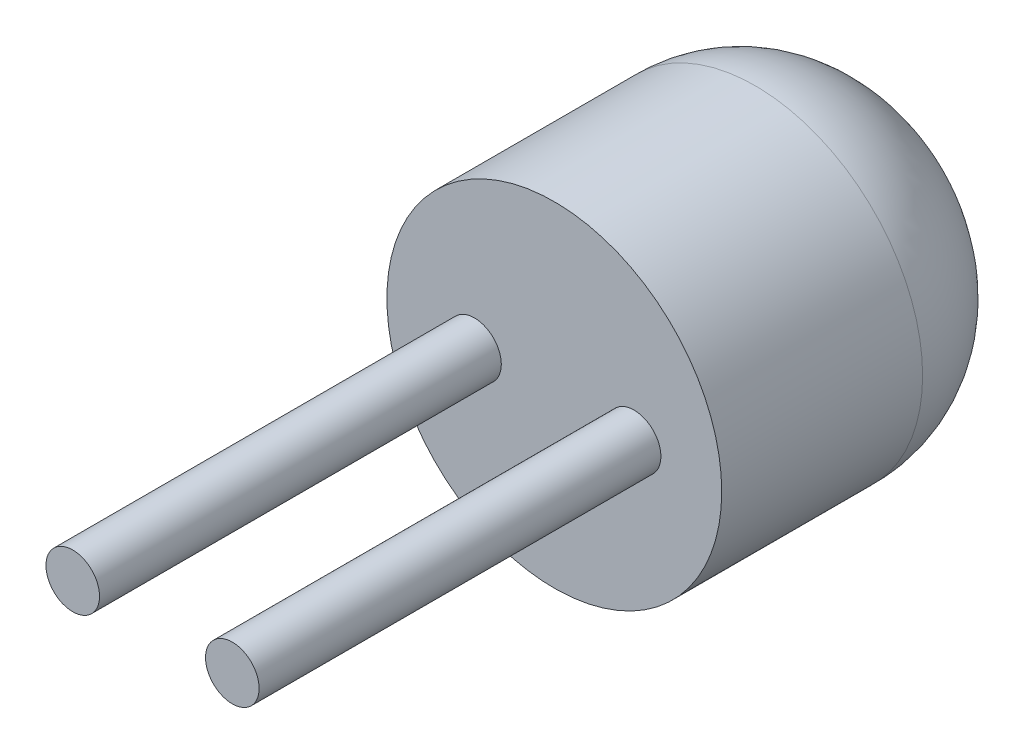
ISO-10303-21;
HEADER;
FILE_DESCRIPTION(('STEP AP214'),'2;1');
FILE_NAME('part.step','',(''),(''),'','','');
FILE_SCHEMA(('AUTOMOTIVE_DESIGN { 1 0 10303 214 1 1 1 1 }'));
ENDSEC;
DATA;
#1=APPLICATION_CONTEXT('core data for automotive mechanical design processes');
#2=APPLICATION_PROTOCOL_DEFINITION('international standard','automotive_design',2000,#1);
#3=PRODUCT_CONTEXT('',#1,'mechanical');
#4=PRODUCT('Part','Part','',(#3));
#5=PRODUCT_RELATED_PRODUCT_CATEGORY('part','',(#4));
#6=PRODUCT_DEFINITION_FORMATION('','',#4);
#7=PRODUCT_DEFINITION_CONTEXT('part definition',#1,'design');
#8=PRODUCT_DEFINITION('design','',#6,#7);
#9=PRODUCT_DEFINITION_SHAPE('','',#8);
#10=(LENGTH_UNIT() NAMED_UNIT(*) SI_UNIT(.MILLI.,.METRE.));
#11=(NAMED_UNIT(*) PLANE_ANGLE_UNIT() SI_UNIT($,.RADIAN.));
#12=(NAMED_UNIT(*) SI_UNIT($,.STERADIAN.) SOLID_ANGLE_UNIT());
#13=UNCERTAINTY_MEASURE_WITH_UNIT(LENGTH_MEASURE(1.E-05),#10,'distance_accuracy_value','');
#14=(GEOMETRIC_REPRESENTATION_CONTEXT(3) GLOBAL_UNCERTAINTY_ASSIGNED_CONTEXT((#13)) GLOBAL_UNIT_ASSIGNED_CONTEXT((#10,
#11,#12)) REPRESENTATION_CONTEXT('',''));
#15=CARTESIAN_POINT('',(0.,0.,0.));
#16=DIRECTION('',(0.,0.,1.));
#17=DIRECTION('',(1.,0.,0.));
#18=AXIS2_PLACEMENT_3D('',#15,#16,#17);
#19=CARTESIAN_POINT('',(-53.,46.9999999999999,-5.));
#20=DIRECTION('',(0.,0.,1.));
#21=DIRECTION('',(1.,0.,0.));
#22=AXIS2_PLACEMENT_3D('',#19,#20,#21);
#23=CYLINDRICAL_SURFACE('',#22,2.5);
#24=CARTESIAN_POINT('',(-53.,46.9999999999999,-3.));
#25=DIRECTION('',(0.,0.,1.));
#26=DIRECTION('',(1.,0.,0.));
#27=AXIS2_PLACEMENT_3D('',#24,#25,#26);
#28=CIRCLE('',#27,2.5);
#29=CARTESIAN_POINT('',(-50.5,46.9999999999999,-3.));
#30=VERTEX_POINT('',#29);
#31=EDGE_CURVE('E37',#30,#30,#28,.T.);
#32=ORIENTED_EDGE('',*,*,#31,.T.);
#33=EDGE_LOOP('',(#32));
#34=FACE_BOUND('',#33,.T.);
#35=CARTESIAN_POINT('',(-53.,46.9999999999999,0.));
#36=DIRECTION('',(0.,0.,1.));
#37=DIRECTION('',(1.,0.,0.));
#38=AXIS2_PLACEMENT_3D('',#35,#36,#37);
#39=CIRCLE('',#38,2.5);
#40=CARTESIAN_POINT('',(-50.5,46.9999999999999,0.));
#41=VERTEX_POINT('',#40);
#42=EDGE_CURVE('E41',#41,#41,#39,.T.);
#43=ORIENTED_EDGE('',*,*,#42,.F.);
#44=EDGE_LOOP('',(#43));
#45=FACE_BOUND('',#44,.T.);
#46=ADVANCED_FACE('F30',(#34,#45),#23,.T.);
#47=CARTESIAN_POINT('',(-53.,46.9999999999999,-5.));
#48=DIRECTION('',(0.,0.,1.));
#49=DIRECTION('',(1.,0.,0.));
#50=AXIS2_PLACEMENT_3D('',#47,#48,#49);
#51=PLANE('',#50);
#52=CARTESIAN_POINT('',(-53.,46.9999999999999,-5.));
#53=DIRECTION('',(0.,0.,1.));
#54=DIRECTION('',(1.,0.,0.));
#55=AXIS2_PLACEMENT_3D('',#52,#53,#54);
#56=CIRCLE('',#55,0.499999999999996);
#57=CARTESIAN_POINT('',(-52.5,46.9999999999999,-5.));
#58=VERTEX_POINT('',#57);
#59=EDGE_CURVE('E10',#58,#58,#56,.F.);
#60=ORIENTED_EDGE('',*,*,#59,.T.);
#61=EDGE_LOOP('',(#60));
#62=FACE_BOUND('',#61,.T.);
#63=ADVANCED_FACE('F73',(#62),#51,.F.);
#64=CARTESIAN_POINT('',(-53.,46.9999999999999,0.));
#65=DIRECTION('',(0.,0.,1.));
#66=DIRECTION('',(1.,0.,0.));
#67=AXIS2_PLACEMENT_3D('',#64,#65,#66);
#68=PLANE('',#67);
#69=CARTESIAN_POINT('',(-51.8084478668295,46.9999999999999,0.));
#70=DIRECTION('',(0.,0.,1.));
#71=DIRECTION('',(-1.,0.,0.));
#72=AXIS2_PLACEMENT_3D('',#69,#70,#71);
#73=CIRCLE('',#72,0.399999999999997);
#74=CARTESIAN_POINT('',(-52.2084478668295,46.9999999999999,0.));
#75=VERTEX_POINT('',#74);
#76=EDGE_CURVE('E54',#75,#75,#73,.T.);
#77=ORIENTED_EDGE('',*,*,#76,.F.);
#78=EDGE_LOOP('',(#77));
#79=FACE_BOUND('',#78,.T.);
#80=CARTESIAN_POINT('',(-54.1915521331706,46.9999999999999,0.));
#81=DIRECTION('',(0.,0.,1.));
#82=DIRECTION('',(1.,0.,0.));
#83=AXIS2_PLACEMENT_3D('',#80,#81,#82);
#84=CIRCLE('',#83,0.399999999999997);
#85=CARTESIAN_POINT('',(-53.7915521331706,46.9999999999999,0.));
#86=VERTEX_POINT('',#85);
#87=EDGE_CURVE('E48',#86,#86,#84,.T.);
#88=ORIENTED_EDGE('',*,*,#87,.F.);
#89=EDGE_LOOP('',(#88));
#90=FACE_BOUND('',#89,.T.);
#91=ORIENTED_EDGE('',*,*,#42,.T.);
#92=EDGE_LOOP('',(#91));
#93=FACE_BOUND('',#92,.T.);
#94=ADVANCED_FACE('F69',(#79,#90,#93),#68,.T.);
#95=CARTESIAN_POINT('',(-54.1915521331706,46.9999999999999,6.));
#96=DIRECTION('',(0.,0.,-1.));
#97=DIRECTION('',(-1.,0.,0.));
#98=AXIS2_PLACEMENT_3D('',#95,#96,#97);
#99=CYLINDRICAL_SURFACE('',#98,0.399999999999997);
#100=CARTESIAN_POINT('',(-54.1915521331706,46.9999999999999,6.));
#101=DIRECTION('',(0.,0.,1.));
#102=DIRECTION('',(1.,0.,0.));
#103=AXIS2_PLACEMENT_3D('',#100,#101,#102);
#104=CIRCLE('',#103,0.399999999999997);
#105=CARTESIAN_POINT('',(-53.7915521331706,46.9999999999999,6.));
#106=VERTEX_POINT('',#105);
#107=EDGE_CURVE('E45',#106,#106,#104,.T.);
#108=ORIENTED_EDGE('',*,*,#107,.F.);
#109=EDGE_LOOP('',(#108));
#110=FACE_BOUND('',#109,.T.);
#111=ORIENTED_EDGE('',*,*,#87,.T.);
#112=EDGE_LOOP('',(#111));
#113=FACE_BOUND('',#112,.T.);
#114=ADVANCED_FACE('F72',(#110,#113),#99,.T.);
#115=CARTESIAN_POINT('',(-54.1915521331706,46.9999999999999,6.));
#116=DIRECTION('',(0.,0.,1.));
#117=DIRECTION('',(1.,0.,0.));
#118=AXIS2_PLACEMENT_3D('',#115,#116,#117);
#119=PLANE('',#118);
#120=ORIENTED_EDGE('',*,*,#107,.T.);
#121=EDGE_LOOP('',(#120));
#122=FACE_BOUND('',#121,.T.);
#123=ADVANCED_FACE('F65',(#122),#119,.T.);
#124=CARTESIAN_POINT('',(-51.8084478668295,46.9999999999999,6.));
#125=DIRECTION('',(0.,0.,-1.));
#126=DIRECTION('',(-1.,0.,0.));
#127=AXIS2_PLACEMENT_3D('',#124,#125,#126);
#128=CYLINDRICAL_SURFACE('',#127,0.399999999999997);
#129=CARTESIAN_POINT('',(-51.8084478668295,46.9999999999999,6.));
#130=DIRECTION('',(0.,0.,1.));
#131=DIRECTION('',(-1.,0.,0.));
#132=AXIS2_PLACEMENT_3D('',#129,#130,#131);
#133=CIRCLE('',#132,0.399999999999997);
#134=CARTESIAN_POINT('',(-52.2084478668295,46.9999999999999,6.));
#135=VERTEX_POINT('',#134);
#136=EDGE_CURVE('E51',#135,#135,#133,.T.);
#137=ORIENTED_EDGE('',*,*,#136,.F.);
#138=EDGE_LOOP('',(#137));
#139=FACE_BOUND('',#138,.T.);
#140=ORIENTED_EDGE('',*,*,#76,.T.);
#141=EDGE_LOOP('',(#140));
#142=FACE_BOUND('',#141,.T.);
#143=ADVANCED_FACE('F62',(#139,#142),#128,.T.);
#144=CARTESIAN_POINT('',(-51.8084478668295,46.9999999999999,6.));
#145=DIRECTION('',(0.,0.,-1.));
#146=DIRECTION('',(-1.,0.,0.));
#147=AXIS2_PLACEMENT_3D('',#144,#145,#146);
#148=PLANE('',#147);
#149=ORIENTED_EDGE('',*,*,#136,.T.);
#150=EDGE_LOOP('',(#149));
#151=FACE_BOUND('',#150,.T.);
#152=ADVANCED_FACE('F60',(#151),#148,.F.);
#153=CARTESIAN_POINT('',(-53.,46.9999999999999,-3.));
#154=DIRECTION('',(0.,0.,1.));
#155=DIRECTION('',(1.,0.,0.));
#156=AXIS2_PLACEMENT_3D('',#153,#154,#155);
#157=DEGENERATE_TOROIDAL_SURFACE('',#156,0.499999999999996,2.,.T.);
#158=ORIENTED_EDGE('',*,*,#59,.F.);
#159=EDGE_LOOP('',(#158));
#160=FACE_BOUND('',#159,.T.);
#161=ORIENTED_EDGE('',*,*,#31,.F.);
#162=EDGE_LOOP('',(#161));
#163=FACE_BOUND('',#162,.T.);
#164=ADVANCED_FACE('F32',(#160,#163),#157,.T.);
#165=CLOSED_SHELL('',(#46,#63,#94,#114,#123,#143,#152,#164));
#166=MANIFOLD_SOLID_BREP('B2',#165);
#167=ADVANCED_BREP_SHAPE_REPRESENTATION('',(#18,#166),#14);
#168=SHAPE_DEFINITION_REPRESENTATION(#9,#167);
ENDSEC;
END-ISO-10303-21;
